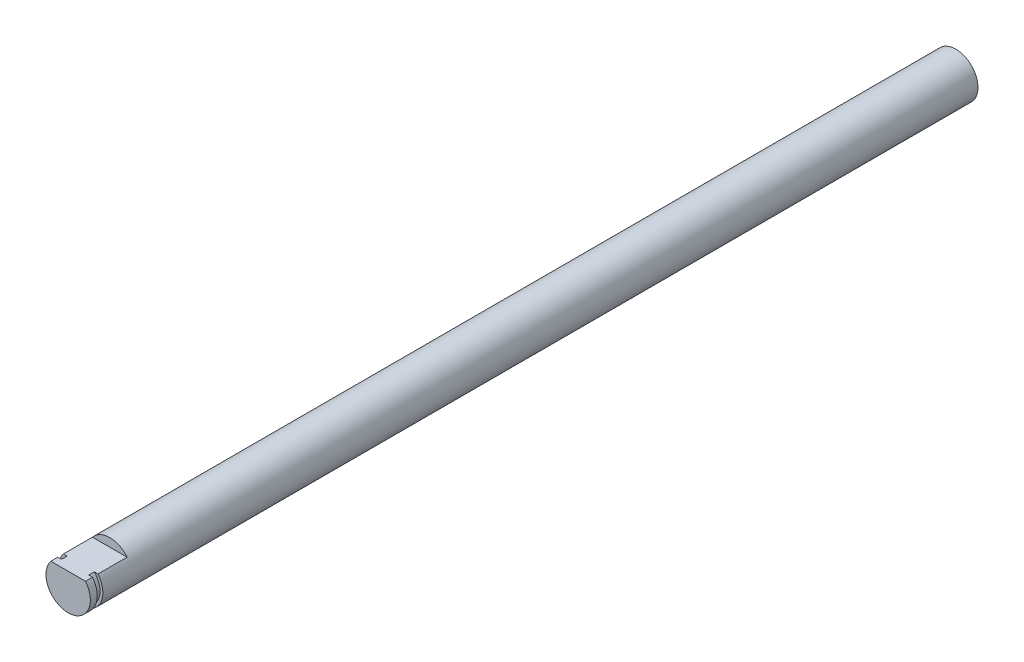
ISO-10303-21;
HEADER;
FILE_DESCRIPTION(('STEP AP214'),'2;1');
FILE_NAME('part.step','',(''),(''),'','','');
FILE_SCHEMA(('AUTOMOTIVE_DESIGN { 1 0 10303 214 1 1 1 1 }'));
ENDSEC;
DATA;
#1=APPLICATION_CONTEXT('core data for automotive mechanical design processes');
#2=APPLICATION_PROTOCOL_DEFINITION('international standard','automotive_design',2000,#1);
#3=PRODUCT_CONTEXT('',#1,'mechanical');
#4=PRODUCT('Part','Part','',(#3));
#5=PRODUCT_RELATED_PRODUCT_CATEGORY('part','',(#4));
#6=PRODUCT_DEFINITION_FORMATION('','',#4);
#7=PRODUCT_DEFINITION_CONTEXT('part definition',#1,'design');
#8=PRODUCT_DEFINITION('design','',#6,#7);
#9=PRODUCT_DEFINITION_SHAPE('','',#8);
#10=(LENGTH_UNIT() NAMED_UNIT(*) SI_UNIT(.MILLI.,.METRE.));
#11=(NAMED_UNIT(*) PLANE_ANGLE_UNIT() SI_UNIT($,.RADIAN.));
#12=(NAMED_UNIT(*) SI_UNIT($,.STERADIAN.) SOLID_ANGLE_UNIT());
#13=UNCERTAINTY_MEASURE_WITH_UNIT(LENGTH_MEASURE(1.E-05),#10,'distance_accuracy_value','');
#14=(GEOMETRIC_REPRESENTATION_CONTEXT(3) GLOBAL_UNCERTAINTY_ASSIGNED_CONTEXT((#13)) GLOBAL_UNIT_ASSIGNED_CONTEXT((#10,
#11,#12)) REPRESENTATION_CONTEXT('',''));
#15=CARTESIAN_POINT('',(0.,0.,0.));
#16=DIRECTION('',(0.,0.,1.));
#17=DIRECTION('',(1.,0.,0.));
#18=AXIS2_PLACEMENT_3D('',#15,#16,#17);
#19=CARTESIAN_POINT('',(0.,0.,160.));
#20=DIRECTION('',(0.,0.,-1.));
#21=DIRECTION('',(-1.,0.,0.));
#22=AXIS2_PLACEMENT_3D('',#19,#20,#21);
#23=CYLINDRICAL_SURFACE('',#22,4.);
#24=CARTESIAN_POINT('',(0.,0.,0.));
#25=DIRECTION('',(0.,0.,1.));
#26=DIRECTION('',(1.,0.,0.));
#27=AXIS2_PLACEMENT_3D('',#24,#25,#26);
#28=CIRCLE('',#27,4.);
#29=CARTESIAN_POINT('',(4.,0.,0.));
#30=VERTEX_POINT('',#29);
#31=EDGE_CURVE('E112',#30,#30,#28,.T.);
#32=ORIENTED_EDGE('',*,*,#31,.T.);
#33=EDGE_LOOP('',(#32));
#34=FACE_BOUND('',#33,.T.);
#35=CARTESIAN_POINT('',(0.,0.,157.75));
#36=DIRECTION('',(0.,0.,1.));
#37=DIRECTION('',(1.,0.,0.));
#38=AXIS2_PLACEMENT_3D('',#35,#36,#37);
#39=CIRCLE('',#38,4.);
#40=CARTESIAN_POINT('',(-3.1224989991992,2.5,157.75));
#41=VERTEX_POINT('',#40);
#42=CARTESIAN_POINT('',(3.1224989991992,2.5,157.75));
#43=VERTEX_POINT('',#42);
#44=EDGE_CURVE('E96',#41,#43,#39,.T.);
#45=ORIENTED_EDGE('',*,*,#44,.F.);
#46=DIRECTION('',(0.,0.,1.));
#47=VECTOR('',#46,1.);
#48=CARTESIAN_POINT('',(-3.1224989991992,2.5,152.5));
#49=LINE('',#48,#47);
#50=CARTESIAN_POINT('',(-3.1224989991992,2.5,152.5));
#51=VERTEX_POINT('',#50);
#52=EDGE_CURVE('E118',#51,#41,#49,.T.);
#53=ORIENTED_EDGE('',*,*,#52,.F.);
#54=CARTESIAN_POINT('',(0.,0.,152.5));
#55=DIRECTION('',(0.,0.,1.));
#56=DIRECTION('',(1.,0.,0.));
#57=AXIS2_PLACEMENT_3D('',#54,#55,#56);
#58=CIRCLE('',#57,4.);
#59=CARTESIAN_POINT('',(3.1224989991992,2.5,152.5));
#60=VERTEX_POINT('',#59);
#61=EDGE_CURVE('E125',#60,#51,#58,.T.);
#62=ORIENTED_EDGE('',*,*,#61,.F.);
#63=DIRECTION('',(0.,0.,1.));
#64=VECTOR('',#63,1.);
#65=CARTESIAN_POINT('',(3.1224989991992,2.5,152.5));
#66=LINE('',#65,#64);
#67=EDGE_CURVE('E115',#60,#43,#66,.T.);
#68=ORIENTED_EDGE('',*,*,#67,.T.);
#69=EDGE_LOOP('',(#45,#53,#62,#68));
#70=FACE_BOUND('',#69,.T.);
#71=ADVANCED_FACE('F35',(#34,#70),#23,.T.);
#72=CARTESIAN_POINT('',(3.1224989991992,2.5,152.5));
#73=DIRECTION('',(0.,-1.,0.));
#74=DIRECTION('',(0.,0.,-1.));
#75=AXIS2_PLACEMENT_3D('',#72,#73,#74);
#76=PLANE('',#75);
#77=DIRECTION('',(-1.,0.,0.));
#78=VECTOR('',#77,1.);
#79=CARTESIAN_POINT('',(3.1224989991992,2.5,157.75));
#80=LINE('',#79,#78);
#81=CARTESIAN_POINT('',(2.44948974278318,2.5,157.75));
#82=VERTEX_POINT('',#81);
#83=EDGE_CURVE('E11',#43,#82,#80,.T.);
#84=ORIENTED_EDGE('',*,*,#83,.F.);
#85=ORIENTED_EDGE('',*,*,#67,.F.);
#86=DIRECTION('',(1.,0.,0.));
#87=VECTOR('',#86,1.);
#88=CARTESIAN_POINT('',(3.1224989991992,2.5,152.5));
#89=LINE('',#88,#87);
#90=EDGE_CURVE('E126',#51,#60,#89,.T.);
#91=ORIENTED_EDGE('',*,*,#90,.F.);
#92=ORIENTED_EDGE('',*,*,#52,.T.);
#93=CARTESIAN_POINT('',(-2.44948974278318,2.5,157.75));
#94=VERTEX_POINT('',#93);
#95=EDGE_CURVE('E45',#94,#41,#80,.T.);
#96=ORIENTED_EDGE('',*,*,#95,.F.);
#97=DIRECTION('',(0.,0.,1.));
#98=VECTOR('',#97,1.);
#99=CARTESIAN_POINT('',(-2.44948974278318,2.5,157.75));
#100=LINE('',#99,#98);
#101=CARTESIAN_POINT('',(-2.44948974278318,2.5,158.75));
#102=VERTEX_POINT('',#101);
#103=EDGE_CURVE('E101',#102,#94,#100,.F.);
#104=ORIENTED_EDGE('',*,*,#103,.F.);
#105=DIRECTION('',(-1.,0.,0.));
#106=VECTOR('',#105,1.);
#107=CARTESIAN_POINT('',(3.1224989991992,2.5,158.75));
#108=LINE('',#107,#106);
#109=CARTESIAN_POINT('',(-3.1224989991992,2.5,158.75));
#110=VERTEX_POINT('',#109);
#111=EDGE_CURVE('E108',#102,#110,#108,.T.);
#112=ORIENTED_EDGE('',*,*,#111,.T.);
#113=CARTESIAN_POINT('',(-3.1224989991992,2.5,160.));
#114=VERTEX_POINT('',#113);
#115=EDGE_CURVE('E60',#110,#114,#49,.T.);
#116=ORIENTED_EDGE('',*,*,#115,.T.);
#117=DIRECTION('',(1.,0.,0.));
#118=VECTOR('',#117,1.);
#119=CARTESIAN_POINT('',(3.1224989991992,2.5,160.));
#120=LINE('',#119,#118);
#121=CARTESIAN_POINT('',(3.1224989991992,2.5,160.));
#122=VERTEX_POINT('',#121);
#123=EDGE_CURVE('E123',#114,#122,#120,.T.);
#124=ORIENTED_EDGE('',*,*,#123,.T.);
#125=CARTESIAN_POINT('',(3.1224989991992,2.5,158.75));
#126=VERTEX_POINT('',#125);
#127=EDGE_CURVE('E121',#126,#122,#66,.T.);
#128=ORIENTED_EDGE('',*,*,#127,.F.);
#129=CARTESIAN_POINT('',(2.44948974278318,2.5,158.75));
#130=VERTEX_POINT('',#129);
#131=EDGE_CURVE('E44',#126,#130,#108,.T.);
#132=ORIENTED_EDGE('',*,*,#131,.T.);
#133=DIRECTION('',(0.,0.,1.));
#134=VECTOR('',#133,1.);
#135=CARTESIAN_POINT('',(2.44948974278318,2.5,157.75));
#136=LINE('',#135,#134);
#137=EDGE_CURVE('E39',#82,#130,#136,.T.);
#138=ORIENTED_EDGE('',*,*,#137,.F.);
#139=EDGE_LOOP('',(#84,#85,#91,#92,#96,#104,#112,#116,#124,#128,#132,#138));
#140=FACE_BOUND('',#139,.T.);
#141=ADVANCED_FACE('F105',(#140),#76,.F.);
#142=ORIENTED_EDGE('',*,*,#115,.F.);
#143=CARTESIAN_POINT('',(0.,0.,158.75));
#144=DIRECTION('',(0.,0.,1.));
#145=DIRECTION('',(1.,0.,0.));
#146=AXIS2_PLACEMENT_3D('',#143,#144,#145);
#147=CIRCLE('',#146,4.);
#148=EDGE_CURVE('E102',#110,#126,#147,.T.);
#149=ORIENTED_EDGE('',*,*,#148,.T.);
#150=ORIENTED_EDGE('',*,*,#127,.T.);
#151=CARTESIAN_POINT('',(0.,0.,160.));
#152=DIRECTION('',(0.,0.,1.));
#153=DIRECTION('',(1.,0.,0.));
#154=AXIS2_PLACEMENT_3D('',#151,#152,#153);
#155=CIRCLE('',#154,4.);
#156=EDGE_CURVE('E111',#114,#122,#155,.T.);
#157=ORIENTED_EDGE('',*,*,#156,.F.);
#158=EDGE_LOOP('',(#142,#149,#150,#157));
#159=FACE_BOUND('',#158,.T.);
#160=ADVANCED_FACE('F37',(#159),#23,.T.);
#161=CARTESIAN_POINT('',(0.,0.,160.));
#162=DIRECTION('',(0.,0.,1.));
#163=DIRECTION('',(1.,0.,0.));
#164=AXIS2_PLACEMENT_3D('',#161,#162,#163);
#165=PLANE('',#164);
#166=ORIENTED_EDGE('',*,*,#123,.F.);
#167=ORIENTED_EDGE('',*,*,#156,.T.);
#168=EDGE_LOOP('',(#166,#167));
#169=FACE_BOUND('',#168,.T.);
#170=ADVANCED_FACE('F149',(#169),#165,.T.);
#171=CARTESIAN_POINT('',(0.,0.,0.));
#172=DIRECTION('',(0.,0.,1.));
#173=DIRECTION('',(1.,0.,0.));
#174=AXIS2_PLACEMENT_3D('',#171,#172,#173);
#175=PLANE('',#174);
#176=ORIENTED_EDGE('',*,*,#31,.F.);
#177=EDGE_LOOP('',(#176));
#178=FACE_BOUND('',#177,.T.);
#179=ADVANCED_FACE('F142',(#178),#175,.F.);
#180=CARTESIAN_POINT('',(0.,0.,152.5));
#181=DIRECTION('',(0.,0.,1.));
#182=DIRECTION('',(1.,0.,0.));
#183=AXIS2_PLACEMENT_3D('',#180,#181,#182);
#184=PLANE('',#183);
#185=ORIENTED_EDGE('',*,*,#61,.T.);
#186=ORIENTED_EDGE('',*,*,#90,.T.);
#187=EDGE_LOOP('',(#185,#186));
#188=FACE_BOUND('',#187,.T.);
#189=ADVANCED_FACE('F140',(#188),#184,.T.);
#190=CARTESIAN_POINT('',(0.,0.,157.75));
#191=DIRECTION('',(0.,0.,1.));
#192=DIRECTION('',(1.,0.,0.));
#193=AXIS2_PLACEMENT_3D('',#190,#191,#192);
#194=PLANE('',#193);
#195=ORIENTED_EDGE('',*,*,#83,.T.);
#196=CARTESIAN_POINT('',(0.,0.,157.75));
#197=DIRECTION('',(0.,0.,1.));
#198=DIRECTION('',(1.,0.,0.));
#199=AXIS2_PLACEMENT_3D('',#196,#197,#198);
#200=CIRCLE('',#199,3.5);
#201=EDGE_CURVE('E93',#94,#82,#200,.T.);
#202=ORIENTED_EDGE('',*,*,#201,.F.);
#203=ORIENTED_EDGE('',*,*,#95,.T.);
#204=ORIENTED_EDGE('',*,*,#44,.T.);
#205=EDGE_LOOP('',(#195,#202,#203,#204));
#206=FACE_BOUND('',#205,.T.);
#207=ADVANCED_FACE('F92',(#206),#194,.T.);
#208=CARTESIAN_POINT('',(0.,0.,158.75));
#209=DIRECTION('',(0.,0.,1.));
#210=DIRECTION('',(1.,0.,0.));
#211=AXIS2_PLACEMENT_3D('',#208,#209,#210);
#212=PLANE('',#211);
#213=ORIENTED_EDGE('',*,*,#148,.F.);
#214=ORIENTED_EDGE('',*,*,#111,.F.);
#215=CARTESIAN_POINT('',(0.,0.,158.75));
#216=DIRECTION('',(0.,0.,1.));
#217=DIRECTION('',(1.,0.,0.));
#218=AXIS2_PLACEMENT_3D('',#215,#216,#217);
#219=CIRCLE('',#218,3.5);
#220=EDGE_CURVE('E52',#102,#130,#219,.T.);
#221=ORIENTED_EDGE('',*,*,#220,.T.);
#222=ORIENTED_EDGE('',*,*,#131,.F.);
#223=EDGE_LOOP('',(#213,#214,#221,#222));
#224=FACE_BOUND('',#223,.T.);
#225=ADVANCED_FACE('F134',(#224),#212,.F.);
#226=CARTESIAN_POINT('',(0.,0.,157.75));
#227=DIRECTION('',(0.,0.,1.));
#228=DIRECTION('',(1.,0.,0.));
#229=AXIS2_PLACEMENT_3D('',#226,#227,#228);
#230=CYLINDRICAL_SURFACE('',#229,3.5);
#231=ORIENTED_EDGE('',*,*,#137,.T.);
#232=ORIENTED_EDGE('',*,*,#220,.F.);
#233=ORIENTED_EDGE('',*,*,#103,.T.);
#234=ORIENTED_EDGE('',*,*,#201,.T.);
#235=EDGE_LOOP('',(#231,#232,#233,#234));
#236=FACE_BOUND('',#235,.T.);
#237=ADVANCED_FACE('F99',(#236),#230,.T.);
#238=CLOSED_SHELL('',(#71,#141,#160,#170,#179,#189,#207,#225,#237));
#239=MANIFOLD_SOLID_BREP('B2',#238);
#240=ADVANCED_BREP_SHAPE_REPRESENTATION('',(#18,#239),#14);
#241=SHAPE_DEFINITION_REPRESENTATION(#9,#240);
ENDSEC;
END-ISO-10303-21;
